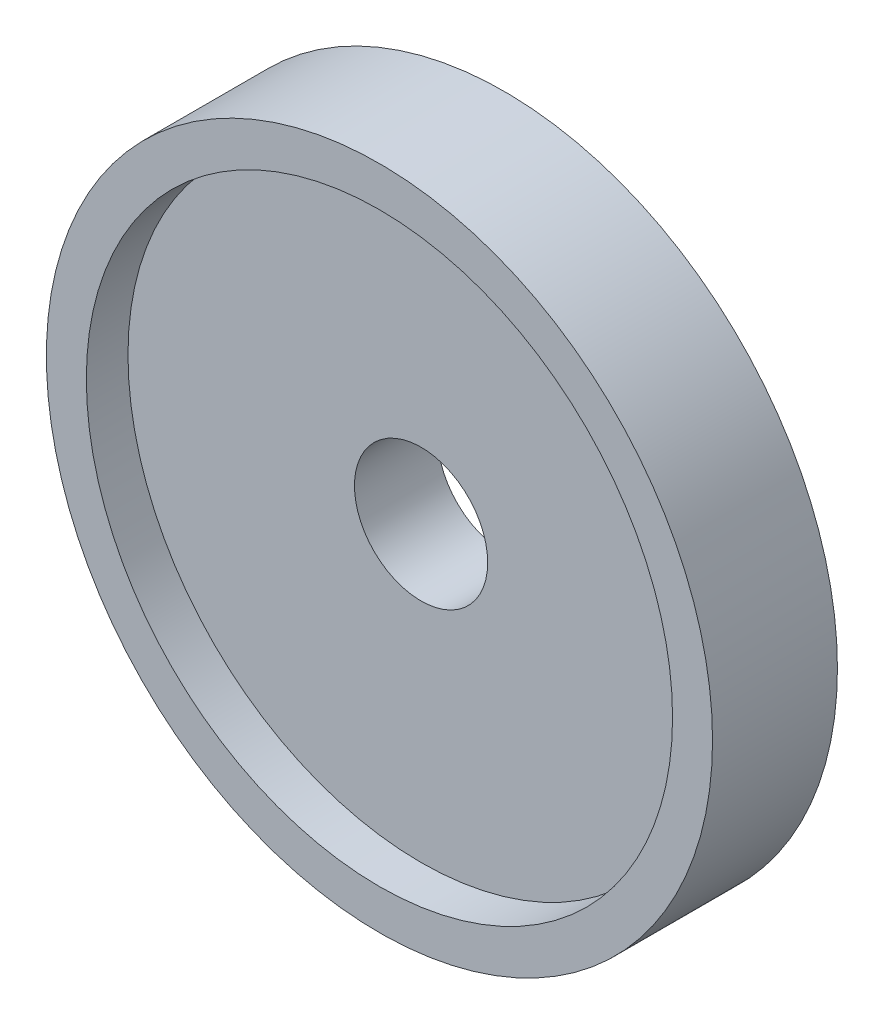
ISO-10303-21;
HEADER;
FILE_DESCRIPTION(('STEP AP214'),'2;1');
FILE_NAME('part.step','',(''),(''),'','','');
FILE_SCHEMA(('AUTOMOTIVE_DESIGN { 1 0 10303 214 1 1 1 1 }'));
ENDSEC;
DATA;
#1=APPLICATION_CONTEXT('core data for automotive mechanical design processes');
#2=APPLICATION_PROTOCOL_DEFINITION('international standard','automotive_design',2000,#1);
#3=PRODUCT_CONTEXT('',#1,'mechanical');
#4=PRODUCT('Part','Part','',(#3));
#5=PRODUCT_RELATED_PRODUCT_CATEGORY('part','',(#4));
#6=PRODUCT_DEFINITION_FORMATION('','',#4);
#7=PRODUCT_DEFINITION_CONTEXT('part definition',#1,'design');
#8=PRODUCT_DEFINITION('design','',#6,#7);
#9=PRODUCT_DEFINITION_SHAPE('','',#8);
#10=(LENGTH_UNIT() NAMED_UNIT(*) SI_UNIT(.MILLI.,.METRE.));
#11=(NAMED_UNIT(*) PLANE_ANGLE_UNIT() SI_UNIT($,.RADIAN.));
#12=(NAMED_UNIT(*) SI_UNIT($,.STERADIAN.) SOLID_ANGLE_UNIT());
#13=UNCERTAINTY_MEASURE_WITH_UNIT(LENGTH_MEASURE(1.E-05),#10,'distance_accuracy_value','');
#14=(GEOMETRIC_REPRESENTATION_CONTEXT(3) GLOBAL_UNCERTAINTY_ASSIGNED_CONTEXT((#13)) GLOBAL_UNIT_ASSIGNED_CONTEXT((#10,
#11,#12)) REPRESENTATION_CONTEXT('',''));
#15=CARTESIAN_POINT('',(0.,0.,0.));
#16=DIRECTION('',(0.,0.,1.));
#17=DIRECTION('',(1.,0.,0.));
#18=AXIS2_PLACEMENT_3D('',#15,#16,#17);
#19=CARTESIAN_POINT('',(1.76,0.,0.75));
#20=DIRECTION('',(0.,0.,1.));
#21=DIRECTION('',(1.,0.,0.));
#22=AXIS2_PLACEMENT_3D('',#19,#20,#21);
#23=PLANE('',#22);
#24=CARTESIAN_POINT('',(0.,0.,0.75));
#25=DIRECTION('',(0.,0.,1.));
#26=DIRECTION('',(1.,0.,0.));
#27=AXIS2_PLACEMENT_3D('',#24,#25,#26);
#28=CIRCLE('',#27,2.);
#29=CARTESIAN_POINT('',(2.,0.,0.75));
#30=VERTEX_POINT('',#29);
#31=EDGE_CURVE('E10',#30,#30,#28,.T.);
#32=ORIENTED_EDGE('',*,*,#31,.T.);
#33=EDGE_LOOP('',(#32));
#34=FACE_BOUND('',#33,.T.);
#35=CARTESIAN_POINT('',(0.,0.,0.75));
#36=DIRECTION('',(0.,0.,1.));
#37=DIRECTION('',(1.,0.,0.));
#38=AXIS2_PLACEMENT_3D('',#35,#36,#37);
#39=CIRCLE('',#38,1.76);
#40=CARTESIAN_POINT('',(1.76,0.,0.75));
#41=VERTEX_POINT('',#40);
#42=EDGE_CURVE('E57',#41,#41,#39,.T.);
#43=ORIENTED_EDGE('',*,*,#42,.F.);
#44=EDGE_LOOP('',(#43));
#45=FACE_BOUND('',#44,.T.);
#46=ADVANCED_FACE('F35',(#34,#45),#23,.T.);
#47=CARTESIAN_POINT('',(0.,0.,0.));
#48=DIRECTION('',(0.,0.,1.));
#49=DIRECTION('',(1.,0.,0.));
#50=AXIS2_PLACEMENT_3D('',#47,#48,#49);
#51=CYLINDRICAL_SURFACE('',#50,2.);
#52=CARTESIAN_POINT('',(0.,0.,0.));
#53=DIRECTION('',(0.,0.,1.));
#54=DIRECTION('',(1.,0.,0.));
#55=AXIS2_PLACEMENT_3D('',#52,#53,#54);
#56=CIRCLE('',#55,2.);
#57=CARTESIAN_POINT('',(2.,0.,0.));
#58=VERTEX_POINT('',#57);
#59=EDGE_CURVE('E41',#58,#58,#56,.T.);
#60=ORIENTED_EDGE('',*,*,#59,.T.);
#61=EDGE_LOOP('',(#60));
#62=FACE_BOUND('',#61,.T.);
#63=ORIENTED_EDGE('',*,*,#31,.F.);
#64=EDGE_LOOP('',(#63));
#65=FACE_BOUND('',#64,.T.);
#66=ADVANCED_FACE('F65',(#62,#65),#51,.T.);
#67=CARTESIAN_POINT('',(2.,0.,0.));
#68=DIRECTION('',(0.,0.,-1.));
#69=DIRECTION('',(-1.,0.,0.));
#70=AXIS2_PLACEMENT_3D('',#67,#68,#69);
#71=PLANE('',#70);
#72=CARTESIAN_POINT('',(0.,0.,0.));
#73=DIRECTION('',(0.,0.,1.));
#74=DIRECTION('',(1.,0.,0.));
#75=AXIS2_PLACEMENT_3D('',#72,#73,#74);
#76=CIRCLE('',#75,0.4);
#77=CARTESIAN_POINT('',(0.4,0.,0.));
#78=VERTEX_POINT('',#77);
#79=EDGE_CURVE('E45',#78,#78,#76,.T.);
#80=ORIENTED_EDGE('',*,*,#79,.T.);
#81=EDGE_LOOP('',(#80));
#82=FACE_BOUND('',#81,.T.);
#83=ORIENTED_EDGE('',*,*,#59,.F.);
#84=EDGE_LOOP('',(#83));
#85=FACE_BOUND('',#84,.T.);
#86=ADVANCED_FACE('F69',(#82,#85),#71,.T.);
#87=CARTESIAN_POINT('',(0.,0.,0.));
#88=DIRECTION('',(0.,0.,1.));
#89=DIRECTION('',(1.,0.,0.));
#90=AXIS2_PLACEMENT_3D('',#87,#88,#89);
#91=CYLINDRICAL_SURFACE('',#90,0.4);
#92=CARTESIAN_POINT('',(0.,0.,0.5));
#93=DIRECTION('',(0.,0.,1.));
#94=DIRECTION('',(1.,0.,0.));
#95=AXIS2_PLACEMENT_3D('',#92,#93,#94);
#96=CIRCLE('',#95,0.4);
#97=CARTESIAN_POINT('',(0.4,0.,0.5));
#98=VERTEX_POINT('',#97);
#99=EDGE_CURVE('E49',#98,#98,#96,.T.);
#100=ORIENTED_EDGE('',*,*,#99,.T.);
#101=EDGE_LOOP('',(#100));
#102=FACE_BOUND('',#101,.T.);
#103=ORIENTED_EDGE('',*,*,#79,.F.);
#104=EDGE_LOOP('',(#103));
#105=FACE_BOUND('',#104,.T.);
#106=ADVANCED_FACE('F73',(#102,#105),#91,.F.);
#107=CARTESIAN_POINT('',(0.4,0.,0.5));
#108=DIRECTION('',(0.,0.,1.));
#109=DIRECTION('',(1.,0.,0.));
#110=AXIS2_PLACEMENT_3D('',#107,#108,#109);
#111=PLANE('',#110);
#112=CARTESIAN_POINT('',(0.,0.,0.5));
#113=DIRECTION('',(0.,0.,1.));
#114=DIRECTION('',(1.,0.,0.));
#115=AXIS2_PLACEMENT_3D('',#112,#113,#114);
#116=CIRCLE('',#115,1.76);
#117=CARTESIAN_POINT('',(1.76,0.,0.5));
#118=VERTEX_POINT('',#117);
#119=EDGE_CURVE('E54',#118,#118,#116,.T.);
#120=ORIENTED_EDGE('',*,*,#119,.T.);
#121=EDGE_LOOP('',(#120));
#122=FACE_BOUND('',#121,.T.);
#123=ORIENTED_EDGE('',*,*,#99,.F.);
#124=EDGE_LOOP('',(#123));
#125=FACE_BOUND('',#124,.T.);
#126=ADVANCED_FACE('F80',(#122,#125),#111,.T.);
#127=CARTESIAN_POINT('',(0.,0.,0.));
#128=DIRECTION('',(0.,0.,1.));
#129=DIRECTION('',(1.,0.,0.));
#130=AXIS2_PLACEMENT_3D('',#127,#128,#129);
#131=CYLINDRICAL_SURFACE('',#130,1.76);
#132=ORIENTED_EDGE('',*,*,#42,.T.);
#133=EDGE_LOOP('',(#132));
#134=FACE_BOUND('',#133,.T.);
#135=ORIENTED_EDGE('',*,*,#119,.F.);
#136=EDGE_LOOP('',(#135));
#137=FACE_BOUND('',#136,.T.);
#138=ADVANCED_FACE('F61',(#134,#137),#131,.F.);
#139=CLOSED_SHELL('',(#46,#66,#86,#106,#126,#138));
#140=MANIFOLD_SOLID_BREP('B2',#139);
#141=ADVANCED_BREP_SHAPE_REPRESENTATION('',(#18,#140),#14);
#142=SHAPE_DEFINITION_REPRESENTATION(#9,#141);
ENDSEC;
END-ISO-10303-21;
